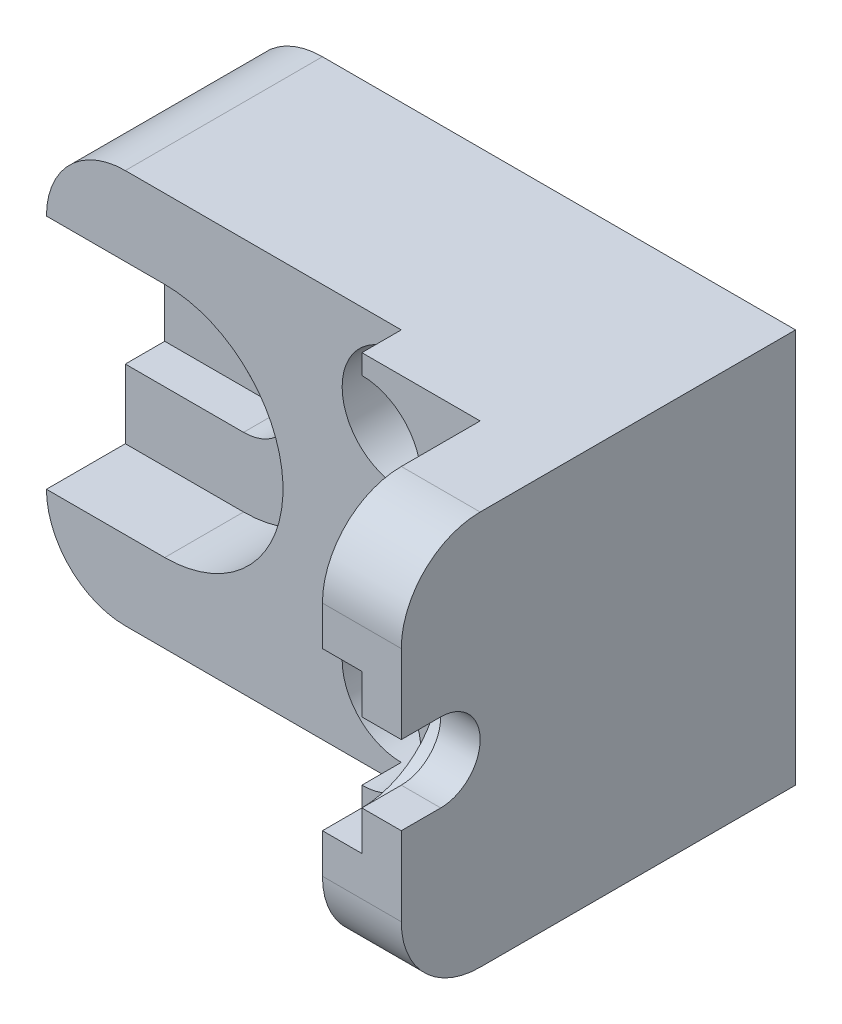
ISO-10303-21;
HEADER;
FILE_DESCRIPTION(('STEP AP214'),'2;1');
FILE_NAME('part.step','',(''),(''),'','','');
FILE_SCHEMA(('AUTOMOTIVE_DESIGN { 1 0 10303 214 1 1 1 1 }'));
ENDSEC;
DATA;
#1=APPLICATION_CONTEXT('core data for automotive mechanical design processes');
#2=APPLICATION_PROTOCOL_DEFINITION('international standard','automotive_design',2000,#1);
#3=PRODUCT_CONTEXT('',#1,'mechanical');
#4=PRODUCT('Part','Part','',(#3));
#5=PRODUCT_RELATED_PRODUCT_CATEGORY('part','',(#4));
#6=PRODUCT_DEFINITION_FORMATION('','',#4);
#7=PRODUCT_DEFINITION_CONTEXT('part definition',#1,'design');
#8=PRODUCT_DEFINITION('design','',#6,#7);
#9=PRODUCT_DEFINITION_SHAPE('','',#8);
#10=(LENGTH_UNIT() NAMED_UNIT(*) SI_UNIT(.MILLI.,.METRE.));
#11=(NAMED_UNIT(*) PLANE_ANGLE_UNIT() SI_UNIT($,.RADIAN.));
#12=(NAMED_UNIT(*) SI_UNIT($,.STERADIAN.) SOLID_ANGLE_UNIT());
#13=UNCERTAINTY_MEASURE_WITH_UNIT(LENGTH_MEASURE(1.E-05),#10,'distance_accuracy_value','');
#14=(GEOMETRIC_REPRESENTATION_CONTEXT(3) GLOBAL_UNCERTAINTY_ASSIGNED_CONTEXT((#13)) GLOBAL_UNIT_ASSIGNED_CONTEXT((#10,
#11,#12)) REPRESENTATION_CONTEXT('',''));
#15=CARTESIAN_POINT('',(0.,0.,0.));
#16=DIRECTION('',(0.,0.,1.));
#17=DIRECTION('',(1.,0.,0.));
#18=AXIS2_PLACEMENT_3D('',#15,#16,#17);
#19=CARTESIAN_POINT('',(9.,8.,6.));
#20=DIRECTION('',(0.,0.,-1.));
#21=DIRECTION('',(-1.,0.,0.));
#22=AXIS2_PLACEMENT_3D('',#19,#20,#21);
#23=CYLINDRICAL_SURFACE('',#22,0.500000000000001);
#24=CARTESIAN_POINT('',(9.,8.,0.));
#25=DIRECTION('',(0.,0.,1.));
#26=DIRECTION('',(1.,0.,0.));
#27=AXIS2_PLACEMENT_3D('',#24,#25,#26);
#28=CIRCLE('',#27,0.500000000000001);
#29=CARTESIAN_POINT('',(9.5,8.,0.));
#30=VERTEX_POINT('',#29);
#31=EDGE_CURVE('E392',#30,#30,#28,.T.);
#32=ORIENTED_EDGE('',*,*,#31,.F.);
#33=EDGE_LOOP('',(#32));
#34=FACE_BOUND('',#33,.T.);
#35=CARTESIAN_POINT('',(9.,8.,2.));
#36=DIRECTION('',(0.,0.,1.));
#37=DIRECTION('',(1.,0.,0.));
#38=AXIS2_PLACEMENT_3D('',#35,#36,#37);
#39=CIRCLE('',#38,0.500000000000001);
#40=CARTESIAN_POINT('',(9.5,8.,2.));
#41=VERTEX_POINT('',#40);
#42=EDGE_CURVE('E39',#41,#41,#39,.T.);
#43=ORIENTED_EDGE('',*,*,#42,.T.);
#44=EDGE_LOOP('',(#43));
#45=FACE_BOUND('',#44,.T.);
#46=ADVANCED_FACE('F35',(#34,#45),#23,.F.);
#47=CARTESIAN_POINT('',(9.,2.,6.));
#48=DIRECTION('',(0.,0.,-1.));
#49=DIRECTION('',(-1.,0.,0.));
#50=AXIS2_PLACEMENT_3D('',#47,#48,#49);
#51=CYLINDRICAL_SURFACE('',#50,0.500000000000001);
#52=CARTESIAN_POINT('',(9.,2.,0.));
#53=DIRECTION('',(0.,0.,1.));
#54=DIRECTION('',(1.,0.,0.));
#55=AXIS2_PLACEMENT_3D('',#52,#53,#54);
#56=CIRCLE('',#55,0.500000000000001);
#57=CARTESIAN_POINT('',(9.5,2.,0.));
#58=VERTEX_POINT('',#57);
#59=EDGE_CURVE('E374',#58,#58,#56,.T.);
#60=ORIENTED_EDGE('',*,*,#59,.F.);
#61=EDGE_LOOP('',(#60));
#62=FACE_BOUND('',#61,.T.);
#63=CARTESIAN_POINT('',(9.,2.,2.));
#64=DIRECTION('',(0.,0.,1.));
#65=DIRECTION('',(1.,0.,0.));
#66=AXIS2_PLACEMENT_3D('',#63,#64,#65);
#67=CIRCLE('',#66,0.500000000000001);
#68=CARTESIAN_POINT('',(9.5,2.,2.));
#69=VERTEX_POINT('',#68);
#70=EDGE_CURVE('E456',#69,#69,#67,.T.);
#71=ORIENTED_EDGE('',*,*,#70,.T.);
#72=EDGE_LOOP('',(#71));
#73=FACE_BOUND('',#72,.T.);
#74=ADVANCED_FACE('F580',(#62,#73),#51,.F.);
#75=CARTESIAN_POINT('',(0.,2.00000000000001,6.));
#76=DIRECTION('',(1.,0.,0.));
#77=DIRECTION('',(0.,0.,-1.));
#78=AXIS2_PLACEMENT_3D('',#75,#76,#77);
#79=PLANE('',#78);
#80=DIRECTION('',(0.,-1.,0.));
#81=VECTOR('',#80,1.);
#82=CARTESIAN_POINT('',(0.,2.00000000000001,3.));
#83=LINE('',#82,#81);
#84=CARTESIAN_POINT('',(0.,3.75,3.));
#85=VERTEX_POINT('',#84);
#86=CARTESIAN_POINT('',(0.,2.,3.));
#87=VERTEX_POINT('',#86);
#88=EDGE_CURVE('E454',#85,#87,#83,.T.);
#89=ORIENTED_EDGE('',*,*,#88,.F.);
#90=DIRECTION('',(0.,0.,-1.));
#91=VECTOR('',#90,1.);
#92=CARTESIAN_POINT('',(0.,3.75,6.));
#93=LINE('',#92,#91);
#94=CARTESIAN_POINT('',(0.,3.75,2.));
#95=VERTEX_POINT('',#94);
#96=EDGE_CURVE('E485',#85,#95,#93,.T.);
#97=ORIENTED_EDGE('',*,*,#96,.T.);
#98=DIRECTION('',(0.,-1.,0.));
#99=VECTOR('',#98,1.);
#100=CARTESIAN_POINT('',(0.,2.00000000000001,2.));
#101=LINE('',#100,#99);
#102=CARTESIAN_POINT('',(0.,6.25,2.));
#103=VERTEX_POINT('',#102);
#104=EDGE_CURVE('E488',#103,#95,#101,.T.);
#105=ORIENTED_EDGE('',*,*,#104,.F.);
#106=DIRECTION('',(0.,0.,1.));
#107=VECTOR('',#106,1.);
#108=CARTESIAN_POINT('',(0.,6.25,6.));
#109=LINE('',#108,#107);
#110=CARTESIAN_POINT('',(0.,6.25,3.));
#111=VERTEX_POINT('',#110);
#112=EDGE_CURVE('E481',#103,#111,#109,.T.);
#113=ORIENTED_EDGE('',*,*,#112,.T.);
#114=CARTESIAN_POINT('',(0.,8.,3.));
#115=VERTEX_POINT('',#114);
#116=EDGE_CURVE('E278',#115,#111,#83,.T.);
#117=ORIENTED_EDGE('',*,*,#116,.F.);
#118=DIRECTION('',(0.,0.,-1.));
#119=VECTOR('',#118,1.);
#120=CARTESIAN_POINT('',(0.,7.99999999999999,6.));
#121=LINE('',#120,#119);
#122=CARTESIAN_POINT('',(0.,7.99999999999999,0.));
#123=VERTEX_POINT('',#122);
#124=EDGE_CURVE('E429',#115,#123,#121,.T.);
#125=ORIENTED_EDGE('',*,*,#124,.T.);
#126=DIRECTION('',(0.,-1.,0.));
#127=VECTOR('',#126,1.);
#128=CARTESIAN_POINT('',(0.,2.00000000000001,0.));
#129=LINE('',#128,#127);
#130=CARTESIAN_POINT('',(0.,2.00000000000001,0.));
#131=VERTEX_POINT('',#130);
#132=EDGE_CURVE('E414',#123,#131,#129,.T.);
#133=ORIENTED_EDGE('',*,*,#132,.T.);
#134=DIRECTION('',(0.,0.,-1.));
#135=VECTOR('',#134,1.);
#136=CARTESIAN_POINT('',(0.,2.00000000000001,6.));
#137=LINE('',#136,#135);
#138=EDGE_CURVE('E425',#87,#131,#137,.T.);
#139=ORIENTED_EDGE('',*,*,#138,.F.);
#140=EDGE_LOOP('',(#89,#97,#105,#113,#117,#125,#133,#139));
#141=FACE_BOUND('',#140,.T.);
#142=ADVANCED_FACE('F518',(#141),#79,.F.);
#143=CARTESIAN_POINT('',(3.,5.,6.));
#144=DIRECTION('',(0.,0.,-1.));
#145=DIRECTION('',(-1.,0.,0.));
#146=AXIS2_PLACEMENT_3D('',#143,#144,#145);
#147=CYLINDRICAL_SURFACE('',#146,1.25);
#148=DIRECTION('',(0.,0.,1.));
#149=VECTOR('',#148,1.);
#150=CARTESIAN_POINT('',(3.,3.75,2.));
#151=LINE('',#150,#149);
#152=CARTESIAN_POINT('',(3.,3.75,2.));
#153=VERTEX_POINT('',#152);
#154=CARTESIAN_POINT('',(3.,3.75,3.));
#155=VERTEX_POINT('',#154);
#156=EDGE_CURVE('E478',#153,#155,#151,.T.);
#157=ORIENTED_EDGE('',*,*,#156,.T.);
#158=CARTESIAN_POINT('',(3.,5.,3.));
#159=DIRECTION('',(0.,0.,1.));
#160=DIRECTION('',(1.,0.,0.));
#161=AXIS2_PLACEMENT_3D('',#158,#159,#160);
#162=CIRCLE('',#161,1.25);
#163=CARTESIAN_POINT('',(3.,6.25,3.));
#164=VERTEX_POINT('',#163);
#165=EDGE_CURVE('E451',#155,#164,#162,.T.);
#166=ORIENTED_EDGE('',*,*,#165,.T.);
#167=DIRECTION('',(0.,0.,1.));
#168=VECTOR('',#167,1.);
#169=CARTESIAN_POINT('',(3.,6.25,2.));
#170=LINE('',#169,#168);
#171=CARTESIAN_POINT('',(3.,6.25,2.));
#172=VERTEX_POINT('',#171);
#173=EDGE_CURVE('E52',#172,#164,#170,.T.);
#174=ORIENTED_EDGE('',*,*,#173,.F.);
#175=CARTESIAN_POINT('',(3.,5.,2.));
#176=DIRECTION('',(0.,0.,1.));
#177=DIRECTION('',(1.,0.,0.));
#178=AXIS2_PLACEMENT_3D('',#175,#176,#177);
#179=CIRCLE('',#178,1.25);
#180=EDGE_CURVE('E11',#172,#153,#179,.T.);
#181=ORIENTED_EDGE('',*,*,#180,.T.);
#182=EDGE_LOOP('',(#157,#166,#174,#181));
#183=FACE_BOUND('',#182,.T.);
#184=CARTESIAN_POINT('',(3.,5.,0.));
#185=DIRECTION('',(0.,0.,1.));
#186=DIRECTION('',(1.,0.,0.));
#187=AXIS2_PLACEMENT_3D('',#184,#185,#186);
#188=CIRCLE('',#187,1.25);
#189=CARTESIAN_POINT('',(4.25,5.,0.));
#190=VERTEX_POINT('',#189);
#191=EDGE_CURVE('E395',#190,#190,#188,.T.);
#192=ORIENTED_EDGE('',*,*,#191,.F.);
#193=EDGE_LOOP('',(#192));
#194=FACE_BOUND('',#193,.T.);
#195=ADVANCED_FACE('F566',(#183,#194),#147,.F.);
#196=CARTESIAN_POINT('',(2.,8.,6.));
#197=DIRECTION('',(0.,0.,-1.));
#198=DIRECTION('',(-1.,0.,0.));
#199=AXIS2_PLACEMENT_3D('',#196,#197,#198);
#200=CYLINDRICAL_SURFACE('',#199,2.);
#201=CARTESIAN_POINT('',(2.,8.,5.));
#202=DIRECTION('',(0.,0.,1.));
#203=DIRECTION('',(1.,0.,0.));
#204=AXIS2_PLACEMENT_3D('',#201,#202,#203);
#205=CIRCLE('',#204,2.);
#206=CARTESIAN_POINT('',(2.00000000000001,10.,5.));
#207=VERTEX_POINT('',#206);
#208=CARTESIAN_POINT('',(0.,8.,5.));
#209=VERTEX_POINT('',#208);
#210=EDGE_CURVE('E294',#207,#209,#205,.T.);
#211=ORIENTED_EDGE('',*,*,#210,.F.);
#212=DIRECTION('',(0.,0.,-1.));
#213=VECTOR('',#212,1.);
#214=CARTESIAN_POINT('',(2.00000000000001,10.,6.));
#215=LINE('',#214,#213);
#216=CARTESIAN_POINT('',(2.00000000000001,10.,0.));
#217=VERTEX_POINT('',#216);
#218=EDGE_CURVE('E432',#207,#217,#215,.T.);
#219=ORIENTED_EDGE('',*,*,#218,.T.);
#220=CARTESIAN_POINT('',(2.,8.,0.));
#221=DIRECTION('',(0.,0.,1.));
#222=DIRECTION('',(-1.,0.,0.));
#223=AXIS2_PLACEMENT_3D('',#220,#221,#222);
#224=CIRCLE('',#223,2.);
#225=EDGE_CURVE('E411',#217,#123,#224,.T.);
#226=ORIENTED_EDGE('',*,*,#225,.T.);
#227=ORIENTED_EDGE('',*,*,#124,.F.);
#228=EDGE_CURVE('E430',#209,#115,#121,.T.);
#229=ORIENTED_EDGE('',*,*,#228,.F.);
#230=EDGE_LOOP('',(#211,#219,#226,#227,#229));
#231=FACE_BOUND('',#230,.T.);
#232=ADVANCED_FACE('F551',(#231),#200,.T.);
#233=CARTESIAN_POINT('',(2.,2.,6.));
#234=DIRECTION('',(0.,0.,-1.));
#235=DIRECTION('',(-1.,0.,0.));
#236=AXIS2_PLACEMENT_3D('',#233,#234,#235);
#237=CYLINDRICAL_SURFACE('',#236,2.);
#238=CARTESIAN_POINT('',(2.,2.,5.));
#239=DIRECTION('',(0.,0.,1.));
#240=DIRECTION('',(1.,0.,0.));
#241=AXIS2_PLACEMENT_3D('',#238,#239,#240);
#242=CIRCLE('',#241,2.);
#243=CARTESIAN_POINT('',(0.,2.,5.));
#244=VERTEX_POINT('',#243);
#245=CARTESIAN_POINT('',(2.00000000000001,0.,5.));
#246=VERTEX_POINT('',#245);
#247=EDGE_CURVE('E292',#244,#246,#242,.T.);
#248=ORIENTED_EDGE('',*,*,#247,.F.);
#249=EDGE_CURVE('E426',#244,#87,#137,.T.);
#250=ORIENTED_EDGE('',*,*,#249,.T.);
#251=ORIENTED_EDGE('',*,*,#138,.T.);
#252=CARTESIAN_POINT('',(2.,2.,0.));
#253=DIRECTION('',(0.,0.,1.));
#254=DIRECTION('',(-1.,0.,0.));
#255=AXIS2_PLACEMENT_3D('',#252,#253,#254);
#256=CIRCLE('',#255,2.);
#257=CARTESIAN_POINT('',(2.00000000000001,0.,0.));
#258=VERTEX_POINT('',#257);
#259=EDGE_CURVE('E417',#131,#258,#256,.T.);
#260=ORIENTED_EDGE('',*,*,#259,.T.);
#261=DIRECTION('',(0.,0.,-1.));
#262=VECTOR('',#261,1.);
#263=CARTESIAN_POINT('',(2.00000000000001,0.,6.));
#264=LINE('',#263,#262);
#265=EDGE_CURVE('E423',#246,#258,#264,.T.);
#266=ORIENTED_EDGE('',*,*,#265,.F.);
#267=EDGE_LOOP('',(#248,#250,#251,#260,#266));
#268=FACE_BOUND('',#267,.T.);
#269=ADVANCED_FACE('F523',(#268),#237,.T.);
#270=CARTESIAN_POINT('',(12.,3.99999999999999,0.));
#271=DIRECTION('',(0.,1.,0.));
#272=DIRECTION('',(0.,0.,1.));
#273=AXIS2_PLACEMENT_3D('',#270,#271,#272);
#274=PLANE('',#273);
#275=DIRECTION('',(1.,0.,0.));
#276=VECTOR('',#275,1.);
#277=CARTESIAN_POINT('',(12.,4.,9.));
#278=LINE('',#277,#276);
#279=CARTESIAN_POINT('',(13.,4.,9.));
#280=VERTEX_POINT('',#279);
#281=CARTESIAN_POINT('',(14.,4.,9.));
#282=VERTEX_POINT('',#281);
#283=EDGE_CURVE('E372',#280,#282,#278,.T.);
#284=ORIENTED_EDGE('',*,*,#283,.F.);
#285=DIRECTION('',(0.,0.,1.));
#286=VECTOR('',#285,1.);
#287=CARTESIAN_POINT('',(13.,3.99999999999999,0.));
#288=LINE('',#287,#286);
#289=CARTESIAN_POINT('',(13.,4.,10.));
#290=VERTEX_POINT('',#289);
#291=EDGE_CURVE('E321',#280,#290,#288,.T.);
#292=ORIENTED_EDGE('',*,*,#291,.T.);
#293=DIRECTION('',(1.,0.,0.));
#294=VECTOR('',#293,1.);
#295=CARTESIAN_POINT('',(12.,4.,10.));
#296=LINE('',#295,#294);
#297=CARTESIAN_POINT('',(14.,4.,10.));
#298=VERTEX_POINT('',#297);
#299=EDGE_CURVE('E352',#290,#298,#296,.T.);
#300=ORIENTED_EDGE('',*,*,#299,.T.);
#301=DIRECTION('',(0.,0.,1.));
#302=VECTOR('',#301,1.);
#303=CARTESIAN_POINT('',(14.,3.99999999999999,0.));
#304=LINE('',#303,#302);
#305=EDGE_CURVE('E331',#282,#298,#304,.T.);
#306=ORIENTED_EDGE('',*,*,#305,.F.);
#307=EDGE_LOOP('',(#284,#292,#300,#306));
#308=FACE_BOUND('',#307,.T.);
#309=ADVANCED_FACE('F607',(#308),#274,.T.);
#310=CARTESIAN_POINT('',(12.,5.,9.));
#311=DIRECTION('',(1.,0.,0.));
#312=DIRECTION('',(0.,0.,-1.));
#313=AXIS2_PLACEMENT_3D('',#310,#311,#312);
#314=CYLINDRICAL_SURFACE('',#313,1.);
#315=CARTESIAN_POINT('',(13.,5.,9.));
#316=DIRECTION('',(-1.,0.,0.));
#317=DIRECTION('',(0.,0.,1.));
#318=AXIS2_PLACEMENT_3D('',#315,#316,#317);
#319=CIRCLE('',#318,1.);
#320=CARTESIAN_POINT('',(13.,6.,9.));
#321=VERTEX_POINT('',#320);
#322=EDGE_CURVE('E324',#280,#321,#319,.F.);
#323=ORIENTED_EDGE('',*,*,#322,.F.);
#324=ORIENTED_EDGE('',*,*,#283,.T.);
#325=CARTESIAN_POINT('',(14.,5.,9.));
#326=DIRECTION('',(1.,0.,0.));
#327=DIRECTION('',(0.,0.,-1.));
#328=AXIS2_PLACEMENT_3D('',#325,#326,#327);
#329=CIRCLE('',#328,1.);
#330=CARTESIAN_POINT('',(14.,6.,9.));
#331=VERTEX_POINT('',#330);
#332=EDGE_CURVE('E335',#282,#331,#329,.T.);
#333=ORIENTED_EDGE('',*,*,#332,.T.);
#334=DIRECTION('',(1.,0.,0.));
#335=VECTOR('',#334,1.);
#336=CARTESIAN_POINT('',(12.,6.,9.));
#337=LINE('',#336,#335);
#338=EDGE_CURVE('E375',#321,#331,#337,.T.);
#339=ORIENTED_EDGE('',*,*,#338,.F.);
#340=EDGE_LOOP('',(#323,#324,#333,#339));
#341=FACE_BOUND('',#340,.T.);
#342=ADVANCED_FACE('F640',(#341),#314,.F.);
#343=CARTESIAN_POINT('',(12.,6.,0.));
#344=DIRECTION('',(0.,1.,0.));
#345=DIRECTION('',(0.,0.,1.));
#346=AXIS2_PLACEMENT_3D('',#343,#344,#345);
#347=PLANE('',#346);
#348=DIRECTION('',(0.,0.,1.));
#349=VECTOR('',#348,1.);
#350=CARTESIAN_POINT('',(13.,6.,0.));
#351=LINE('',#350,#349);
#352=CARTESIAN_POINT('',(13.,6.,10.));
#353=VERTEX_POINT('',#352);
#354=EDGE_CURVE('E326',#321,#353,#351,.T.);
#355=ORIENTED_EDGE('',*,*,#354,.F.);
#356=ORIENTED_EDGE('',*,*,#338,.T.);
#357=DIRECTION('',(0.,0.,1.));
#358=VECTOR('',#357,1.);
#359=CARTESIAN_POINT('',(14.,6.,0.));
#360=LINE('',#359,#358);
#361=CARTESIAN_POINT('',(14.,6.,10.));
#362=VERTEX_POINT('',#361);
#363=EDGE_CURVE('E367',#331,#362,#360,.T.);
#364=ORIENTED_EDGE('',*,*,#363,.T.);
#365=DIRECTION('',(1.,0.,0.));
#366=VECTOR('',#365,1.);
#367=CARTESIAN_POINT('',(12.,6.,10.));
#368=LINE('',#367,#366);
#369=EDGE_CURVE('E377',#353,#362,#368,.T.);
#370=ORIENTED_EDGE('',*,*,#369,.F.);
#371=EDGE_LOOP('',(#355,#356,#364,#370));
#372=FACE_BOUND('',#371,.T.);
#373=ADVANCED_FACE('F598',(#372),#347,.F.);
#374=CARTESIAN_POINT('',(2.,8.,6.));
#375=DIRECTION('',(0.,0.,-1.));
#376=DIRECTION('',(-1.,0.,0.));
#377=AXIS2_PLACEMENT_3D('',#374,#375,#376);
#378=PLANE('',#377);
#379=DIRECTION('',(-1.,0.,0.));
#380=VECTOR('',#379,1.);
#381=CARTESIAN_POINT('',(2.00000000000001,10.,6.));
#382=LINE('',#381,#380);
#383=CARTESIAN_POINT('',(12.,10.,6.));
#384=VERTEX_POINT('',#383);
#385=CARTESIAN_POINT('',(9.,10.,6.));
#386=VERTEX_POINT('',#385);
#387=EDGE_CURVE('E399',#384,#386,#382,.T.);
#388=ORIENTED_EDGE('',*,*,#387,.T.);
#389=DIRECTION('',(0.,1.,0.));
#390=VECTOR('',#389,1.);
#391=CARTESIAN_POINT('',(9.,10.1155799928734,6.));
#392=LINE('',#391,#390);
#393=CARTESIAN_POINT('',(9.,9.5,6.));
#394=VERTEX_POINT('',#393);
#395=EDGE_CURVE('E272',#394,#386,#392,.T.);
#396=ORIENTED_EDGE('',*,*,#395,.F.);
#397=CARTESIAN_POINT('',(9.,8.,6.));
#398=DIRECTION('',(0.,0.,1.));
#399=DIRECTION('',(1.,0.,0.));
#400=AXIS2_PLACEMENT_3D('',#397,#398,#399);
#401=CIRCLE('',#400,1.5);
#402=CARTESIAN_POINT('',(9.,6.5,6.));
#403=VERTEX_POINT('',#402);
#404=EDGE_CURVE('E282',#403,#394,#401,.T.);
#405=ORIENTED_EDGE('',*,*,#404,.F.);
#406=DIRECTION('',(0.,1.,0.));
#407=VECTOR('',#406,1.);
#408=CARTESIAN_POINT('',(9.,6.5,6.));
#409=LINE('',#408,#407);
#410=CARTESIAN_POINT('',(9.,3.5,6.));
#411=VERTEX_POINT('',#410);
#412=EDGE_CURVE('E280',#411,#403,#409,.T.);
#413=ORIENTED_EDGE('',*,*,#412,.F.);
#414=CARTESIAN_POINT('',(9.,2.,6.));
#415=DIRECTION('',(0.,0.,1.));
#416=DIRECTION('',(1.,0.,0.));
#417=AXIS2_PLACEMENT_3D('',#414,#415,#416);
#418=CIRCLE('',#417,1.5);
#419=CARTESIAN_POINT('',(9.,0.5,6.));
#420=VERTEX_POINT('',#419);
#421=EDGE_CURVE('E259',#420,#411,#418,.T.);
#422=ORIENTED_EDGE('',*,*,#421,.F.);
#423=DIRECTION('',(0.,1.,0.));
#424=VECTOR('',#423,1.);
#425=CARTESIAN_POINT('',(9.,0.5,6.));
#426=LINE('',#425,#424);
#427=CARTESIAN_POINT('',(9.,0.,6.));
#428=VERTEX_POINT('',#427);
#429=EDGE_CURVE('E276',#428,#420,#426,.T.);
#430=ORIENTED_EDGE('',*,*,#429,.F.);
#431=DIRECTION('',(1.,0.,0.));
#432=VECTOR('',#431,1.);
#433=CARTESIAN_POINT('',(2.00000000000001,0.,6.));
#434=LINE('',#433,#432);
#435=CARTESIAN_POINT('',(12.,0.,6.));
#436=VERTEX_POINT('',#435);
#437=EDGE_CURVE('E402',#428,#436,#434,.T.);
#438=ORIENTED_EDGE('',*,*,#437,.T.);
#439=DIRECTION('',(0.,-1.,0.));
#440=VECTOR('',#439,1.);
#441=CARTESIAN_POINT('',(12.,0.,6.));
#442=LINE('',#441,#440);
#443=EDGE_CURVE('E340',#384,#436,#442,.T.);
#444=ORIENTED_EDGE('',*,*,#443,.F.);
#445=EDGE_LOOP('',(#388,#396,#405,#413,#422,#430,#438,#444));
#446=FACE_BOUND('',#445,.T.);
#447=ADVANCED_FACE('F534',(#446),#378,.F.);
#448=CARTESIAN_POINT('',(2.,8.,0.));
#449=DIRECTION('',(0.,0.,-1.));
#450=DIRECTION('',(-1.,0.,0.));
#451=AXIS2_PLACEMENT_3D('',#448,#449,#450);
#452=PLANE('',#451);
#453=ORIENTED_EDGE('',*,*,#31,.T.);
#454=EDGE_LOOP('',(#453));
#455=FACE_BOUND('',#454,.T.);
#456=DIRECTION('',(0.,1.,0.));
#457=VECTOR('',#456,1.);
#458=CARTESIAN_POINT('',(14.,0.,0.));
#459=LINE('',#458,#457);
#460=CARTESIAN_POINT('',(14.,0.,0.));
#461=VERTEX_POINT('',#460);
#462=CARTESIAN_POINT('',(14.,10.,0.));
#463=VERTEX_POINT('',#462);
#464=EDGE_CURVE('E398',#461,#463,#459,.T.);
#465=ORIENTED_EDGE('',*,*,#464,.F.);
#466=DIRECTION('',(1.,0.,0.));
#467=VECTOR('',#466,1.);
#468=CARTESIAN_POINT('',(2.00000000000001,0.,0.));
#469=LINE('',#468,#467);
#470=EDGE_CURVE('E403',#258,#461,#469,.T.);
#471=ORIENTED_EDGE('',*,*,#470,.F.);
#472=ORIENTED_EDGE('',*,*,#259,.F.);
#473=ORIENTED_EDGE('',*,*,#132,.F.);
#474=ORIENTED_EDGE('',*,*,#225,.F.);
#475=DIRECTION('',(-1.,0.,0.));
#476=VECTOR('',#475,1.);
#477=CARTESIAN_POINT('',(2.00000000000001,10.,0.));
#478=LINE('',#477,#476);
#479=EDGE_CURVE('E408',#463,#217,#478,.T.);
#480=ORIENTED_EDGE('',*,*,#479,.F.);
#481=EDGE_LOOP('',(#465,#471,#472,#473,#474,#480));
#482=FACE_BOUND('',#481,.T.);
#483=ORIENTED_EDGE('',*,*,#191,.T.);
#484=EDGE_LOOP('',(#483));
#485=FACE_BOUND('',#484,.T.);
#486=ORIENTED_EDGE('',*,*,#59,.T.);
#487=EDGE_LOOP('',(#486));
#488=FACE_BOUND('',#487,.T.);
#489=ADVANCED_FACE('F597',(#455,#482,#485,#488),#452,.T.);
#490=CARTESIAN_POINT('',(14.,0.,6.));
#491=DIRECTION('',(-1.,0.,0.));
#492=DIRECTION('',(0.,0.,1.));
#493=AXIS2_PLACEMENT_3D('',#490,#491,#492);
#494=PLANE('',#493);
#495=ORIENTED_EDGE('',*,*,#464,.T.);
#496=DIRECTION('',(0.,0.,-1.));
#497=VECTOR('',#496,1.);
#498=CARTESIAN_POINT('',(14.,10.,6.));
#499=LINE('',#498,#497);
#500=CARTESIAN_POINT('',(14.,10.,7.99999999999999));
#501=VERTEX_POINT('',#500);
#502=EDGE_CURVE('E434',#501,#463,#499,.T.);
#503=ORIENTED_EDGE('',*,*,#502,.F.);
#504=CARTESIAN_POINT('',(14.,8.,8.));
#505=DIRECTION('',(1.,0.,0.));
#506=DIRECTION('',(0.,0.,-1.));
#507=AXIS2_PLACEMENT_3D('',#504,#505,#506);
#508=CIRCLE('',#507,2.);
#509=CARTESIAN_POINT('',(14.,7.99999999999999,10.));
#510=VERTEX_POINT('',#509);
#511=EDGE_CURVE('E361',#501,#510,#508,.T.);
#512=ORIENTED_EDGE('',*,*,#511,.T.);
#513=DIRECTION('',(0.,-1.,0.));
#514=VECTOR('',#513,1.);
#515=CARTESIAN_POINT('',(14.,0.,10.));
#516=LINE('',#515,#514);
#517=EDGE_CURVE('E364',#510,#362,#516,.T.);
#518=ORIENTED_EDGE('',*,*,#517,.T.);
#519=ORIENTED_EDGE('',*,*,#363,.F.);
#520=ORIENTED_EDGE('',*,*,#332,.F.);
#521=ORIENTED_EDGE('',*,*,#305,.T.);
#522=DIRECTION('',(0.,-1.,0.));
#523=VECTOR('',#522,1.);
#524=CARTESIAN_POINT('',(14.,0.,10.));
#525=LINE('',#524,#523);
#526=CARTESIAN_POINT('',(14.,2.00000000000001,10.));
#527=VERTEX_POINT('',#526);
#528=EDGE_CURVE('E355',#298,#527,#525,.T.);
#529=ORIENTED_EDGE('',*,*,#528,.T.);
#530=CARTESIAN_POINT('',(14.,2.,8.));
#531=DIRECTION('',(1.,0.,0.));
#532=DIRECTION('',(0.,0.,-1.));
#533=AXIS2_PLACEMENT_3D('',#530,#531,#532);
#534=CIRCLE('',#533,2.);
#535=CARTESIAN_POINT('',(14.,0.,7.99999999999999));
#536=VERTEX_POINT('',#535);
#537=EDGE_CURVE('E358',#536,#527,#534,.F.);
#538=ORIENTED_EDGE('',*,*,#537,.F.);
#539=DIRECTION('',(0.,0.,-1.));
#540=VECTOR('',#539,1.);
#541=CARTESIAN_POINT('',(14.,0.,6.));
#542=LINE('',#541,#540);
#543=EDGE_CURVE('E405',#536,#461,#542,.T.);
#544=ORIENTED_EDGE('',*,*,#543,.T.);
#545=EDGE_LOOP('',(#495,#503,#512,#518,#519,#520,#521,#529,#538,#544));
#546=FACE_BOUND('',#545,.T.);
#547=ADVANCED_FACE('F37',(#546),#494,.F.);
#548=CARTESIAN_POINT('',(2.00000000000001,10.,6.));
#549=DIRECTION('',(0.,-1.,0.));
#550=DIRECTION('',(0.,0.,-1.));
#551=AXIS2_PLACEMENT_3D('',#548,#549,#550);
#552=PLANE('',#551);
#553=DIRECTION('',(-1.,0.,0.));
#554=VECTOR('',#553,1.);
#555=CARTESIAN_POINT('',(2.00000000000001,10.,5.));
#556=LINE('',#555,#554);
#557=CARTESIAN_POINT('',(9.,10.,5.));
#558=VERTEX_POINT('',#557);
#559=EDGE_CURVE('E297',#558,#207,#556,.T.);
#560=ORIENTED_EDGE('',*,*,#559,.F.);
#561=DIRECTION('',(0.,0.,1.));
#562=VECTOR('',#561,1.);
#563=CARTESIAN_POINT('',(9.,10.,6.));
#564=LINE('',#563,#562);
#565=EDGE_CURVE('E446',#558,#386,#564,.T.);
#566=ORIENTED_EDGE('',*,*,#565,.T.);
#567=ORIENTED_EDGE('',*,*,#387,.F.);
#568=DIRECTION('',(0.,0.,1.));
#569=VECTOR('',#568,1.);
#570=CARTESIAN_POINT('',(12.,10.,0.));
#571=LINE('',#570,#569);
#572=CARTESIAN_POINT('',(12.,10.,7.99999999999999));
#573=VERTEX_POINT('',#572);
#574=EDGE_CURVE('E343',#384,#573,#571,.T.);
#575=ORIENTED_EDGE('',*,*,#574,.T.);
#576=DIRECTION('',(1.,0.,0.));
#577=VECTOR('',#576,1.);
#578=CARTESIAN_POINT('',(12.,10.,7.99999999999999));
#579=LINE('',#578,#577);
#580=EDGE_CURVE('E381',#573,#501,#579,.T.);
#581=ORIENTED_EDGE('',*,*,#580,.T.);
#582=ORIENTED_EDGE('',*,*,#502,.T.);
#583=ORIENTED_EDGE('',*,*,#479,.T.);
#584=ORIENTED_EDGE('',*,*,#218,.F.);
#585=EDGE_LOOP('',(#560,#566,#567,#575,#581,#582,#583,#584));
#586=FACE_BOUND('',#585,.T.);
#587=ADVANCED_FACE('F547',(#586),#552,.F.);
#588=CARTESIAN_POINT('',(2.00000000000001,0.,6.));
#589=DIRECTION('',(0.,1.,0.));
#590=DIRECTION('',(0.,0.,1.));
#591=AXIS2_PLACEMENT_3D('',#588,#589,#590);
#592=PLANE('',#591);
#593=ORIENTED_EDGE('',*,*,#437,.F.);
#594=DIRECTION('',(0.,0.,-1.));
#595=VECTOR('',#594,1.);
#596=CARTESIAN_POINT('',(9.,0.,6.));
#597=LINE('',#596,#595);
#598=CARTESIAN_POINT('',(9.,0.,5.));
#599=VERTEX_POINT('',#598);
#600=EDGE_CURVE('E443',#428,#599,#597,.T.);
#601=ORIENTED_EDGE('',*,*,#600,.T.);
#602=DIRECTION('',(1.,0.,0.));
#603=VECTOR('',#602,1.);
#604=CARTESIAN_POINT('',(2.00000000000001,0.,5.));
#605=LINE('',#604,#603);
#606=EDGE_CURVE('E288',#246,#599,#605,.T.);
#607=ORIENTED_EDGE('',*,*,#606,.F.);
#608=ORIENTED_EDGE('',*,*,#265,.T.);
#609=ORIENTED_EDGE('',*,*,#470,.T.);
#610=ORIENTED_EDGE('',*,*,#543,.F.);
#611=DIRECTION('',(1.,0.,0.));
#612=VECTOR('',#611,1.);
#613=CARTESIAN_POINT('',(12.,0.,7.99999999999999));
#614=LINE('',#613,#612);
#615=CARTESIAN_POINT('',(12.,0.,7.99999999999999));
#616=VERTEX_POINT('',#615);
#617=EDGE_CURVE('E384',#616,#536,#614,.T.);
#618=ORIENTED_EDGE('',*,*,#617,.F.);
#619=DIRECTION('',(0.,0.,1.));
#620=VECTOR('',#619,1.);
#621=CARTESIAN_POINT('',(12.,0.,0.));
#622=LINE('',#621,#620);
#623=EDGE_CURVE('E338',#436,#616,#622,.T.);
#624=ORIENTED_EDGE('',*,*,#623,.F.);
#625=EDGE_LOOP('',(#593,#601,#607,#608,#609,#610,#618,#624));
#626=FACE_BOUND('',#625,.T.);
#627=ADVANCED_FACE('F528',(#626),#592,.F.);
#628=CARTESIAN_POINT('',(12.,0.,10.));
#629=DIRECTION('',(0.,0.,1.));
#630=DIRECTION('',(1.,0.,0.));
#631=AXIS2_PLACEMENT_3D('',#628,#629,#630);
#632=PLANE('',#631);
#633=DIRECTION('',(-1.,0.,0.));
#634=VECTOR('',#633,1.);
#635=CARTESIAN_POINT('',(12.,7.,10.));
#636=LINE('',#635,#634);
#637=CARTESIAN_POINT('',(13.,7.,10.));
#638=VERTEX_POINT('',#637);
#639=CARTESIAN_POINT('',(12.,7.,10.));
#640=VERTEX_POINT('',#639);
#641=EDGE_CURVE('E319',#638,#640,#636,.T.);
#642=ORIENTED_EDGE('',*,*,#641,.F.);
#643=DIRECTION('',(0.,-1.,0.));
#644=VECTOR('',#643,1.);
#645=CARTESIAN_POINT('',(13.,0.,10.));
#646=LINE('',#645,#644);
#647=EDGE_CURVE('E328',#638,#353,#646,.T.);
#648=ORIENTED_EDGE('',*,*,#647,.T.);
#649=ORIENTED_EDGE('',*,*,#369,.T.);
#650=ORIENTED_EDGE('',*,*,#517,.F.);
#651=DIRECTION('',(1.,0.,0.));
#652=VECTOR('',#651,1.);
#653=CARTESIAN_POINT('',(12.,7.99999999999999,10.));
#654=LINE('',#653,#652);
#655=CARTESIAN_POINT('',(12.,7.99999999999999,10.));
#656=VERTEX_POINT('',#655);
#657=EDGE_CURVE('E379',#656,#510,#654,.T.);
#658=ORIENTED_EDGE('',*,*,#657,.F.);
#659=DIRECTION('',(0.,-1.,0.));
#660=VECTOR('',#659,1.);
#661=CARTESIAN_POINT('',(12.,0.,10.));
#662=LINE('',#661,#660);
#663=EDGE_CURVE('E349',#656,#640,#662,.T.);
#664=ORIENTED_EDGE('',*,*,#663,.T.);
#665=EDGE_LOOP('',(#642,#648,#649,#650,#658,#664));
#666=FACE_BOUND('',#665,.T.);
#667=ADVANCED_FACE('F604',(#666),#632,.T.);
#668=CARTESIAN_POINT('',(12.,8.,8.));
#669=DIRECTION('',(1.,0.,0.));
#670=DIRECTION('',(0.,0.,-1.));
#671=AXIS2_PLACEMENT_3D('',#668,#669,#670);
#672=CYLINDRICAL_SURFACE('',#671,2.);
#673=ORIENTED_EDGE('',*,*,#511,.F.);
#674=ORIENTED_EDGE('',*,*,#580,.F.);
#675=CARTESIAN_POINT('',(12.,8.,8.));
#676=DIRECTION('',(1.,0.,0.));
#677=DIRECTION('',(0.,0.,-1.));
#678=AXIS2_PLACEMENT_3D('',#675,#676,#677);
#679=CIRCLE('',#678,2.);
#680=EDGE_CURVE('E346',#573,#656,#679,.T.);
#681=ORIENTED_EDGE('',*,*,#680,.T.);
#682=ORIENTED_EDGE('',*,*,#657,.T.);
#683=EDGE_LOOP('',(#673,#674,#681,#682));
#684=FACE_BOUND('',#683,.T.);
#685=ADVANCED_FACE('F627',(#684),#672,.T.);
#686=CARTESIAN_POINT('',(12.,2.,8.));
#687=DIRECTION('',(1.,0.,0.));
#688=DIRECTION('',(0.,0.,-1.));
#689=AXIS2_PLACEMENT_3D('',#686,#687,#688);
#690=CYLINDRICAL_SURFACE('',#689,2.);
#691=ORIENTED_EDGE('',*,*,#537,.T.);
#692=DIRECTION('',(1.,0.,0.));
#693=VECTOR('',#692,1.);
#694=CARTESIAN_POINT('',(12.,2.00000000000001,10.));
#695=LINE('',#694,#693);
#696=CARTESIAN_POINT('',(12.,2.00000000000001,10.));
#697=VERTEX_POINT('',#696);
#698=EDGE_CURVE('E387',#697,#527,#695,.T.);
#699=ORIENTED_EDGE('',*,*,#698,.F.);
#700=CARTESIAN_POINT('',(12.,2.,8.));
#701=DIRECTION('',(1.,0.,0.));
#702=DIRECTION('',(0.,0.,-1.));
#703=AXIS2_PLACEMENT_3D('',#700,#701,#702);
#704=CIRCLE('',#703,2.);
#705=EDGE_CURVE('E334',#616,#697,#704,.F.);
#706=ORIENTED_EDGE('',*,*,#705,.F.);
#707=ORIENTED_EDGE('',*,*,#617,.T.);
#708=EDGE_LOOP('',(#691,#699,#706,#707));
#709=FACE_BOUND('',#708,.T.);
#710=ADVANCED_FACE('F651',(#709),#690,.T.);
#711=CARTESIAN_POINT('',(12.,0.,10.));
#712=DIRECTION('',(0.,0.,1.));
#713=DIRECTION('',(1.,0.,0.));
#714=AXIS2_PLACEMENT_3D('',#711,#712,#713);
#715=PLANE('',#714);
#716=DIRECTION('',(1.,0.,0.));
#717=VECTOR('',#716,1.);
#718=CARTESIAN_POINT('',(12.,3.,10.));
#719=LINE('',#718,#717);
#720=CARTESIAN_POINT('',(12.,3.,10.));
#721=VERTEX_POINT('',#720);
#722=CARTESIAN_POINT('',(13.,3.,10.));
#723=VERTEX_POINT('',#722);
#724=EDGE_CURVE('E315',#721,#723,#719,.T.);
#725=ORIENTED_EDGE('',*,*,#724,.F.);
#726=DIRECTION('',(0.,-1.,0.));
#727=VECTOR('',#726,1.);
#728=CARTESIAN_POINT('',(12.,0.,10.));
#729=LINE('',#728,#727);
#730=EDGE_CURVE('E332',#721,#697,#729,.T.);
#731=ORIENTED_EDGE('',*,*,#730,.T.);
#732=ORIENTED_EDGE('',*,*,#698,.T.);
#733=ORIENTED_EDGE('',*,*,#528,.F.);
#734=ORIENTED_EDGE('',*,*,#299,.F.);
#735=DIRECTION('',(0.,-1.,0.));
#736=VECTOR('',#735,1.);
#737=CARTESIAN_POINT('',(13.,0.,10.));
#738=LINE('',#737,#736);
#739=EDGE_CURVE('E440',#290,#723,#738,.T.);
#740=ORIENTED_EDGE('',*,*,#739,.T.);
#741=EDGE_LOOP('',(#725,#731,#732,#733,#734,#740));
#742=FACE_BOUND('',#741,.T.);
#743=ADVANCED_FACE('F648',(#742),#715,.T.);
#744=CARTESIAN_POINT('',(12.,0.,0.));
#745=DIRECTION('',(1.,0.,0.));
#746=DIRECTION('',(0.,0.,-1.));
#747=AXIS2_PLACEMENT_3D('',#744,#745,#746);
#748=PLANE('',#747);
#749=CARTESIAN_POINT('',(12.,5.,9.));
#750=DIRECTION('',(-1.,0.,0.));
#751=DIRECTION('',(0.,0.,1.));
#752=AXIS2_PLACEMENT_3D('',#749,#750,#751);
#753=CIRCLE('',#752,2.);
#754=CARTESIAN_POINT('',(12.,7.,9.));
#755=VERTEX_POINT('',#754);
#756=CARTESIAN_POINT('',(12.,3.,9.));
#757=VERTEX_POINT('',#756);
#758=EDGE_CURVE('E299',#755,#757,#753,.T.);
#759=ORIENTED_EDGE('',*,*,#758,.F.);
#760=DIRECTION('',(0.,0.,1.));
#761=VECTOR('',#760,1.);
#762=CARTESIAN_POINT('',(12.,7.,0.));
#763=LINE('',#762,#761);
#764=EDGE_CURVE('E437',#755,#640,#763,.T.);
#765=ORIENTED_EDGE('',*,*,#764,.T.);
#766=ORIENTED_EDGE('',*,*,#663,.F.);
#767=ORIENTED_EDGE('',*,*,#680,.F.);
#768=ORIENTED_EDGE('',*,*,#574,.F.);
#769=ORIENTED_EDGE('',*,*,#443,.T.);
#770=ORIENTED_EDGE('',*,*,#623,.T.);
#771=ORIENTED_EDGE('',*,*,#705,.T.);
#772=ORIENTED_EDGE('',*,*,#730,.F.);
#773=DIRECTION('',(0.,0.,1.));
#774=VECTOR('',#773,1.);
#775=CARTESIAN_POINT('',(12.,3.,9.));
#776=LINE('',#775,#774);
#777=EDGE_CURVE('E304',#757,#721,#776,.T.);
#778=ORIENTED_EDGE('',*,*,#777,.F.);
#779=EDGE_LOOP('',(#759,#765,#766,#767,#768,#769,#770,#771,#772,#778));
#780=FACE_BOUND('',#779,.T.);
#781=ADVANCED_FACE('F656',(#780),#748,.F.);
#782=CARTESIAN_POINT('',(13.,5.,9.));
#783=DIRECTION('',(-1.,0.,0.));
#784=DIRECTION('',(0.,0.,1.));
#785=AXIS2_PLACEMENT_3D('',#782,#783,#784);
#786=CYLINDRICAL_SURFACE('',#785,2.);
#787=ORIENTED_EDGE('',*,*,#758,.T.);
#788=DIRECTION('',(-1.,0.,0.));
#789=VECTOR('',#788,1.);
#790=CARTESIAN_POINT('',(13.,3.,9.));
#791=LINE('',#790,#789);
#792=CARTESIAN_POINT('',(13.,3.,9.));
#793=VERTEX_POINT('',#792);
#794=EDGE_CURVE('E309',#793,#757,#791,.T.);
#795=ORIENTED_EDGE('',*,*,#794,.F.);
#796=CARTESIAN_POINT('',(13.,5.,9.));
#797=DIRECTION('',(-1.,0.,0.));
#798=DIRECTION('',(0.,0.,1.));
#799=AXIS2_PLACEMENT_3D('',#796,#797,#798);
#800=CIRCLE('',#799,2.);
#801=CARTESIAN_POINT('',(13.,7.,9.));
#802=VERTEX_POINT('',#801);
#803=EDGE_CURVE('E300',#802,#793,#800,.T.);
#804=ORIENTED_EDGE('',*,*,#803,.F.);
#805=DIRECTION('',(-1.,0.,0.));
#806=VECTOR('',#805,1.);
#807=CARTESIAN_POINT('',(13.,7.,9.));
#808=LINE('',#807,#806);
#809=EDGE_CURVE('E312',#802,#755,#808,.T.);
#810=ORIENTED_EDGE('',*,*,#809,.T.);
#811=EDGE_LOOP('',(#787,#795,#804,#810));
#812=FACE_BOUND('',#811,.T.);
#813=ADVANCED_FACE('F670',(#812),#786,.F.);
#814=CARTESIAN_POINT('',(13.,7.,9.));
#815=DIRECTION('',(0.,1.,0.));
#816=DIRECTION('',(0.,0.,1.));
#817=AXIS2_PLACEMENT_3D('',#814,#815,#816);
#818=PLANE('',#817);
#819=ORIENTED_EDGE('',*,*,#641,.T.);
#820=ORIENTED_EDGE('',*,*,#764,.F.);
#821=ORIENTED_EDGE('',*,*,#809,.F.);
#822=DIRECTION('',(0.,0.,-1.));
#823=VECTOR('',#822,1.);
#824=CARTESIAN_POINT('',(13.,7.,9.));
#825=LINE('',#824,#823);
#826=EDGE_CURVE('E307',#638,#802,#825,.T.);
#827=ORIENTED_EDGE('',*,*,#826,.F.);
#828=EDGE_LOOP('',(#819,#820,#821,#827));
#829=FACE_BOUND('',#828,.T.);
#830=ADVANCED_FACE('F660',(#829),#818,.F.);
#831=CARTESIAN_POINT('',(13.,3.,9.));
#832=DIRECTION('',(0.,-1.,0.));
#833=DIRECTION('',(0.,0.,-1.));
#834=AXIS2_PLACEMENT_3D('',#831,#832,#833);
#835=PLANE('',#834);
#836=ORIENTED_EDGE('',*,*,#724,.T.);
#837=DIRECTION('',(0.,0.,1.));
#838=VECTOR('',#837,1.);
#839=CARTESIAN_POINT('',(13.,3.,9.));
#840=LINE('',#839,#838);
#841=EDGE_CURVE('E303',#793,#723,#840,.T.);
#842=ORIENTED_EDGE('',*,*,#841,.F.);
#843=ORIENTED_EDGE('',*,*,#794,.T.);
#844=ORIENTED_EDGE('',*,*,#777,.T.);
#845=EDGE_LOOP('',(#836,#842,#843,#844));
#846=FACE_BOUND('',#845,.T.);
#847=ADVANCED_FACE('F668',(#846),#835,.F.);
#848=CARTESIAN_POINT('',(13.,5.,9.));
#849=DIRECTION('',(-1.,0.,0.));
#850=DIRECTION('',(0.,0.,1.));
#851=AXIS2_PLACEMENT_3D('',#848,#849,#850);
#852=PLANE('',#851);
#853=ORIENTED_EDGE('',*,*,#826,.T.);
#854=ORIENTED_EDGE('',*,*,#803,.T.);
#855=ORIENTED_EDGE('',*,*,#841,.T.);
#856=ORIENTED_EDGE('',*,*,#739,.F.);
#857=ORIENTED_EDGE('',*,*,#291,.F.);
#858=ORIENTED_EDGE('',*,*,#322,.T.);
#859=ORIENTED_EDGE('',*,*,#354,.T.);
#860=ORIENTED_EDGE('',*,*,#647,.F.);
#861=EDGE_LOOP('',(#853,#854,#855,#856,#857,#858,#859,#860));
#862=FACE_BOUND('',#861,.T.);
#863=ADVANCED_FACE('F664',(#862),#852,.T.);
#864=CARTESIAN_POINT('',(9.,10.1155799928734,5.));
#865=DIRECTION('',(1.,0.,0.));
#866=DIRECTION('',(0.,0.,-1.));
#867=AXIS2_PLACEMENT_3D('',#864,#865,#866);
#868=PLANE('',#867);
#869=DIRECTION('',(0.,1.,0.));
#870=VECTOR('',#869,1.);
#871=CARTESIAN_POINT('',(9.,10.1155799928734,5.));
#872=LINE('',#871,#870);
#873=CARTESIAN_POINT('',(9.,9.5,5.));
#874=VERTEX_POINT('',#873);
#875=EDGE_CURVE('E268',#874,#558,#872,.T.);
#876=ORIENTED_EDGE('',*,*,#875,.F.);
#877=DIRECTION('',(0.,0.,1.));
#878=VECTOR('',#877,1.);
#879=CARTESIAN_POINT('',(9.,9.5,5.));
#880=LINE('',#879,#878);
#881=EDGE_CURVE('E286',#874,#394,#880,.T.);
#882=ORIENTED_EDGE('',*,*,#881,.T.);
#883=ORIENTED_EDGE('',*,*,#395,.T.);
#884=ORIENTED_EDGE('',*,*,#565,.F.);
#885=EDGE_LOOP('',(#876,#882,#883,#884));
#886=FACE_BOUND('',#885,.T.);
#887=ADVANCED_FACE('F771',(#886),#868,.F.);
#888=CARTESIAN_POINT('',(9.,0.5,5.));
#889=DIRECTION('',(1.,0.,0.));
#890=DIRECTION('',(0.,0.,-1.));
#891=AXIS2_PLACEMENT_3D('',#888,#889,#890);
#892=PLANE('',#891);
#893=ORIENTED_EDGE('',*,*,#429,.T.);
#894=DIRECTION('',(0.,0.,1.));
#895=VECTOR('',#894,1.);
#896=CARTESIAN_POINT('',(9.,0.5,5.));
#897=LINE('',#896,#895);
#898=CARTESIAN_POINT('',(9.,0.5,5.));
#899=VERTEX_POINT('',#898);
#900=EDGE_CURVE('E264',#899,#420,#897,.T.);
#901=ORIENTED_EDGE('',*,*,#900,.F.);
#902=DIRECTION('',(0.,1.,0.));
#903=VECTOR('',#902,1.);
#904=CARTESIAN_POINT('',(9.,0.5,5.));
#905=LINE('',#904,#903);
#906=EDGE_CURVE('E248',#599,#899,#905,.T.);
#907=ORIENTED_EDGE('',*,*,#906,.F.);
#908=ORIENTED_EDGE('',*,*,#600,.F.);
#909=EDGE_LOOP('',(#893,#901,#907,#908));
#910=FACE_BOUND('',#909,.T.);
#911=ADVANCED_FACE('F532',(#910),#892,.F.);
#912=CARTESIAN_POINT('',(9.,8.,5.));
#913=DIRECTION('',(0.,0.,1.));
#914=DIRECTION('',(1.,0.,0.));
#915=AXIS2_PLACEMENT_3D('',#912,#913,#914);
#916=PLANE('',#915);
#917=CARTESIAN_POINT('',(9.,8.,5.));
#918=DIRECTION('',(0.,0.,1.));
#919=DIRECTION('',(1.,0.,0.));
#920=AXIS2_PLACEMENT_3D('',#917,#918,#919);
#921=CIRCLE('',#920,1.5);
#922=CARTESIAN_POINT('',(9.,6.5,5.));
#923=VERTEX_POINT('',#922);
#924=EDGE_CURVE('E464',#874,#923,#921,.T.);
#925=ORIENTED_EDGE('',*,*,#924,.F.);
#926=ORIENTED_EDGE('',*,*,#875,.T.);
#927=ORIENTED_EDGE('',*,*,#559,.T.);
#928=ORIENTED_EDGE('',*,*,#210,.T.);
#929=DIRECTION('',(-1.,0.,0.));
#930=VECTOR('',#929,1.);
#931=CARTESIAN_POINT('',(3.,8.,5.));
#932=LINE('',#931,#930);
#933=CARTESIAN_POINT('',(3.,8.,5.));
#934=VERTEX_POINT('',#933);
#935=EDGE_CURVE('E494',#934,#209,#932,.T.);
#936=ORIENTED_EDGE('',*,*,#935,.F.);
#937=CARTESIAN_POINT('',(3.,5.,5.));
#938=DIRECTION('',(0.,0.,1.));
#939=DIRECTION('',(1.,0.,0.));
#940=AXIS2_PLACEMENT_3D('',#937,#938,#939);
#941=CIRCLE('',#940,3.);
#942=CARTESIAN_POINT('',(3.,2.,5.));
#943=VERTEX_POINT('',#942);
#944=EDGE_CURVE('E60',#943,#934,#941,.T.);
#945=ORIENTED_EDGE('',*,*,#944,.F.);
#946=DIRECTION('',(1.,0.,0.));
#947=VECTOR('',#946,1.);
#948=CARTESIAN_POINT('',(9.,2.,5.));
#949=LINE('',#948,#947);
#950=EDGE_CURVE('E449',#244,#943,#949,.T.);
#951=ORIENTED_EDGE('',*,*,#950,.F.);
#952=ORIENTED_EDGE('',*,*,#247,.T.);
#953=ORIENTED_EDGE('',*,*,#606,.T.);
#954=ORIENTED_EDGE('',*,*,#906,.T.);
#955=CARTESIAN_POINT('',(9.,2.,5.));
#956=DIRECTION('',(0.,0.,1.));
#957=DIRECTION('',(1.,0.,0.));
#958=AXIS2_PLACEMENT_3D('',#955,#956,#957);
#959=CIRCLE('',#958,1.5);
#960=CARTESIAN_POINT('',(9.,3.5,5.));
#961=VERTEX_POINT('',#960);
#962=EDGE_CURVE('E242',#961,#899,#959,.T.);
#963=ORIENTED_EDGE('',*,*,#962,.F.);
#964=DIRECTION('',(0.,1.,0.));
#965=VECTOR('',#964,1.);
#966=CARTESIAN_POINT('',(9.,6.5,5.));
#967=LINE('',#966,#965);
#968=EDGE_CURVE('E246',#961,#923,#967,.T.);
#969=ORIENTED_EDGE('',*,*,#968,.T.);
#970=EDGE_LOOP('',(#925,#926,#927,#928,#936,#945,#951,#952,#953,#954,#963,#969));
#971=FACE_BOUND('',#970,.T.);
#972=ADVANCED_FACE('F244',(#971),#916,.T.);
#973=CARTESIAN_POINT('',(9.,8.,5.));
#974=DIRECTION('',(0.,0.,1.));
#975=DIRECTION('',(1.,0.,0.));
#976=AXIS2_PLACEMENT_3D('',#973,#974,#975);
#977=CYLINDRICAL_SURFACE('',#976,1.5);
#978=ORIENTED_EDGE('',*,*,#404,.T.);
#979=ORIENTED_EDGE('',*,*,#881,.F.);
#980=ORIENTED_EDGE('',*,*,#924,.T.);
#981=DIRECTION('',(0.,0.,1.));
#982=VECTOR('',#981,1.);
#983=CARTESIAN_POINT('',(9.,6.5,5.));
#984=LINE('',#983,#982);
#985=EDGE_CURVE('E263',#923,#403,#984,.T.);
#986=ORIENTED_EDGE('',*,*,#985,.T.);
#987=EDGE_LOOP('',(#978,#979,#980,#986));
#988=FACE_BOUND('',#987,.T.);
#989=CARTESIAN_POINT('',(9.,8.,2.));
#990=DIRECTION('',(0.,0.,1.));
#991=DIRECTION('',(1.,0.,0.));
#992=AXIS2_PLACEMENT_3D('',#989,#990,#991);
#993=CIRCLE('',#992,1.5);
#994=CARTESIAN_POINT('',(10.5,8.,2.));
#995=VERTEX_POINT('',#994);
#996=EDGE_CURVE('E458',#995,#995,#993,.T.);
#997=ORIENTED_EDGE('',*,*,#996,.F.);
#998=EDGE_LOOP('',(#997));
#999=FACE_BOUND('',#998,.T.);
#1000=ADVANCED_FACE('F539',(#988,#999),#977,.F.);
#1001=CARTESIAN_POINT('',(9.,6.5,5.));
#1002=DIRECTION('',(1.,0.,0.));
#1003=DIRECTION('',(0.,0.,-1.));
#1004=AXIS2_PLACEMENT_3D('',#1001,#1002,#1003);
#1005=PLANE('',#1004);
#1006=ORIENTED_EDGE('',*,*,#412,.T.);
#1007=ORIENTED_EDGE('',*,*,#985,.F.);
#1008=ORIENTED_EDGE('',*,*,#968,.F.);
#1009=DIRECTION('',(0.,0.,1.));
#1010=VECTOR('',#1009,1.);
#1011=CARTESIAN_POINT('',(9.,3.5,5.));
#1012=LINE('',#1011,#1010);
#1013=EDGE_CURVE('E255',#961,#411,#1012,.T.);
#1014=ORIENTED_EDGE('',*,*,#1013,.T.);
#1015=EDGE_LOOP('',(#1006,#1007,#1008,#1014));
#1016=FACE_BOUND('',#1015,.T.);
#1017=ADVANCED_FACE('F267',(#1016),#1005,.F.);
#1018=CARTESIAN_POINT('',(9.,2.,5.));
#1019=DIRECTION('',(0.,0.,1.));
#1020=DIRECTION('',(1.,0.,0.));
#1021=AXIS2_PLACEMENT_3D('',#1018,#1019,#1020);
#1022=CYLINDRICAL_SURFACE('',#1021,1.5);
#1023=ORIENTED_EDGE('',*,*,#421,.T.);
#1024=ORIENTED_EDGE('',*,*,#1013,.F.);
#1025=ORIENTED_EDGE('',*,*,#962,.T.);
#1026=ORIENTED_EDGE('',*,*,#900,.T.);
#1027=EDGE_LOOP('',(#1023,#1024,#1025,#1026));
#1028=FACE_BOUND('',#1027,.T.);
#1029=CARTESIAN_POINT('',(9.,2.,2.));
#1030=DIRECTION('',(0.,0.,1.));
#1031=DIRECTION('',(1.,0.,0.));
#1032=AXIS2_PLACEMENT_3D('',#1029,#1030,#1031);
#1033=CIRCLE('',#1032,1.5);
#1034=CARTESIAN_POINT('',(10.5,2.,2.));
#1035=VERTEX_POINT('',#1034);
#1036=EDGE_CURVE('E252',#1035,#1035,#1033,.T.);
#1037=ORIENTED_EDGE('',*,*,#1036,.F.);
#1038=EDGE_LOOP('',(#1037));
#1039=FACE_BOUND('',#1038,.T.);
#1040=ADVANCED_FACE('F256',(#1028,#1039),#1022,.F.);
#1041=CARTESIAN_POINT('',(3.,5.,3.));
#1042=DIRECTION('',(0.,0.,1.));
#1043=DIRECTION('',(1.,0.,0.));
#1044=AXIS2_PLACEMENT_3D('',#1041,#1042,#1043);
#1045=PLANE('',#1044);
#1046=DIRECTION('',(1.,0.,0.));
#1047=VECTOR('',#1046,1.);
#1048=CARTESIAN_POINT('',(3.,3.75,3.));
#1049=LINE('',#1048,#1047);
#1050=EDGE_CURVE('E44',#85,#155,#1049,.T.);
#1051=ORIENTED_EDGE('',*,*,#1050,.F.);
#1052=ORIENTED_EDGE('',*,*,#88,.T.);
#1053=DIRECTION('',(1.,0.,0.));
#1054=VECTOR('',#1053,1.);
#1055=CARTESIAN_POINT('',(3.,2.,3.));
#1056=LINE('',#1055,#1054);
#1057=CARTESIAN_POINT('',(3.,2.,3.));
#1058=VERTEX_POINT('',#1057);
#1059=EDGE_CURVE('E497',#87,#1058,#1056,.T.);
#1060=ORIENTED_EDGE('',*,*,#1059,.T.);
#1061=CARTESIAN_POINT('',(3.,5.,3.));
#1062=DIRECTION('',(0.,0.,1.));
#1063=DIRECTION('',(1.,0.,0.));
#1064=AXIS2_PLACEMENT_3D('',#1061,#1062,#1063);
#1065=CIRCLE('',#1064,3.);
#1066=CARTESIAN_POINT('',(3.,8.,3.));
#1067=VERTEX_POINT('',#1066);
#1068=EDGE_CURVE('E490',#1058,#1067,#1065,.T.);
#1069=ORIENTED_EDGE('',*,*,#1068,.T.);
#1070=DIRECTION('',(-1.,0.,0.));
#1071=VECTOR('',#1070,1.);
#1072=CARTESIAN_POINT('',(3.,8.,3.));
#1073=LINE('',#1072,#1071);
#1074=EDGE_CURVE('E493',#1067,#115,#1073,.T.);
#1075=ORIENTED_EDGE('',*,*,#1074,.T.);
#1076=ORIENTED_EDGE('',*,*,#116,.T.);
#1077=DIRECTION('',(-1.,0.,0.));
#1078=VECTOR('',#1077,1.);
#1079=CARTESIAN_POINT('',(3.,6.25,3.));
#1080=LINE('',#1079,#1078);
#1081=EDGE_CURVE('E462',#164,#111,#1080,.T.);
#1082=ORIENTED_EDGE('',*,*,#1081,.F.);
#1083=ORIENTED_EDGE('',*,*,#165,.F.);
#1084=EDGE_LOOP('',(#1051,#1052,#1060,#1069,#1075,#1076,#1082,#1083));
#1085=FACE_BOUND('',#1084,.T.);
#1086=ADVANCED_FACE('F509',(#1085),#1045,.T.);
#1087=CARTESIAN_POINT('',(3.,2.,3.));
#1088=DIRECTION('',(0.,-1.,0.));
#1089=DIRECTION('',(1.,0.,0.));
#1090=AXIS2_PLACEMENT_3D('',#1087,#1088,#1089);
#1091=PLANE('',#1090);
#1092=ORIENTED_EDGE('',*,*,#950,.T.);
#1093=DIRECTION('',(0.,0.,1.));
#1094=VECTOR('',#1093,1.);
#1095=CARTESIAN_POINT('',(3.,2.,3.));
#1096=LINE('',#1095,#1094);
#1097=EDGE_CURVE('E455',#1058,#943,#1096,.T.);
#1098=ORIENTED_EDGE('',*,*,#1097,.F.);
#1099=ORIENTED_EDGE('',*,*,#1059,.F.);
#1100=ORIENTED_EDGE('',*,*,#249,.F.);
#1101=EDGE_LOOP('',(#1092,#1098,#1099,#1100));
#1102=FACE_BOUND('',#1101,.T.);
#1103=ADVANCED_FACE('F515',(#1102),#1091,.F.);
#1104=CARTESIAN_POINT('',(3.,8.,3.));
#1105=DIRECTION('',(0.,1.,0.));
#1106=DIRECTION('',(0.,0.,1.));
#1107=AXIS2_PLACEMENT_3D('',#1104,#1105,#1106);
#1108=PLANE('',#1107);
#1109=ORIENTED_EDGE('',*,*,#1074,.F.);
#1110=DIRECTION('',(0.,0.,1.));
#1111=VECTOR('',#1110,1.);
#1112=CARTESIAN_POINT('',(3.,8.,3.));
#1113=LINE('',#1112,#1111);
#1114=EDGE_CURVE('E499',#1067,#934,#1113,.T.);
#1115=ORIENTED_EDGE('',*,*,#1114,.T.);
#1116=ORIENTED_EDGE('',*,*,#935,.T.);
#1117=ORIENTED_EDGE('',*,*,#228,.T.);
#1118=EDGE_LOOP('',(#1109,#1115,#1116,#1117));
#1119=FACE_BOUND('',#1118,.T.);
#1120=ADVANCED_FACE('F557',(#1119),#1108,.F.);
#1121=CARTESIAN_POINT('',(3.,5.,3.));
#1122=DIRECTION('',(0.,0.,1.));
#1123=DIRECTION('',(1.,0.,0.));
#1124=AXIS2_PLACEMENT_3D('',#1121,#1122,#1123);
#1125=CYLINDRICAL_SURFACE('',#1124,3.);
#1126=ORIENTED_EDGE('',*,*,#944,.T.);
#1127=ORIENTED_EDGE('',*,*,#1114,.F.);
#1128=ORIENTED_EDGE('',*,*,#1068,.F.);
#1129=ORIENTED_EDGE('',*,*,#1097,.T.);
#1130=EDGE_LOOP('',(#1126,#1127,#1128,#1129));
#1131=FACE_BOUND('',#1130,.T.);
#1132=ADVANCED_FACE('F558',(#1131),#1125,.F.);
#1133=CARTESIAN_POINT('',(3.,5.,2.));
#1134=DIRECTION('',(0.,0.,1.));
#1135=DIRECTION('',(1.,0.,0.));
#1136=AXIS2_PLACEMENT_3D('',#1133,#1134,#1135);
#1137=PLANE('',#1136);
#1138=ORIENTED_EDGE('',*,*,#104,.T.);
#1139=DIRECTION('',(1.,0.,0.));
#1140=VECTOR('',#1139,1.);
#1141=CARTESIAN_POINT('',(3.,3.75,2.));
#1142=LINE('',#1141,#1140);
#1143=EDGE_CURVE('E475',#95,#153,#1142,.T.);
#1144=ORIENTED_EDGE('',*,*,#1143,.T.);
#1145=ORIENTED_EDGE('',*,*,#180,.F.);
#1146=DIRECTION('',(-1.,0.,0.));
#1147=VECTOR('',#1146,1.);
#1148=CARTESIAN_POINT('',(3.,6.25,2.));
#1149=LINE('',#1148,#1147);
#1150=EDGE_CURVE('E472',#172,#103,#1149,.T.);
#1151=ORIENTED_EDGE('',*,*,#1150,.T.);
#1152=EDGE_LOOP('',(#1138,#1144,#1145,#1151));
#1153=FACE_BOUND('',#1152,.T.);
#1154=ADVANCED_FACE('F562',(#1153),#1137,.T.);
#1155=CARTESIAN_POINT('',(3.,3.75,2.));
#1156=DIRECTION('',(0.,-1.,0.));
#1157=DIRECTION('',(1.,0.,0.));
#1158=AXIS2_PLACEMENT_3D('',#1155,#1156,#1157);
#1159=PLANE('',#1158);
#1160=ORIENTED_EDGE('',*,*,#1050,.T.);
#1161=ORIENTED_EDGE('',*,*,#156,.F.);
#1162=ORIENTED_EDGE('',*,*,#1143,.F.);
#1163=ORIENTED_EDGE('',*,*,#96,.F.);
#1164=EDGE_LOOP('',(#1160,#1161,#1162,#1163));
#1165=FACE_BOUND('',#1164,.T.);
#1166=ADVANCED_FACE('F569',(#1165),#1159,.F.);
#1167=CARTESIAN_POINT('',(3.,6.25,2.));
#1168=DIRECTION('',(0.,1.,0.));
#1169=DIRECTION('',(-1.,0.,0.));
#1170=AXIS2_PLACEMENT_3D('',#1167,#1168,#1169);
#1171=PLANE('',#1170);
#1172=ORIENTED_EDGE('',*,*,#1150,.F.);
#1173=ORIENTED_EDGE('',*,*,#173,.T.);
#1174=ORIENTED_EDGE('',*,*,#1081,.T.);
#1175=ORIENTED_EDGE('',*,*,#112,.F.);
#1176=EDGE_LOOP('',(#1172,#1173,#1174,#1175));
#1177=FACE_BOUND('',#1176,.T.);
#1178=ADVANCED_FACE('F560',(#1177),#1171,.F.);
#1179=CARTESIAN_POINT('',(9.,2.,2.));
#1180=DIRECTION('',(0.,0.,1.));
#1181=DIRECTION('',(1.,0.,0.));
#1182=AXIS2_PLACEMENT_3D('',#1179,#1180,#1181);
#1183=PLANE('',#1182);
#1184=ORIENTED_EDGE('',*,*,#70,.F.);
#1185=EDGE_LOOP('',(#1184));
#1186=FACE_BOUND('',#1185,.T.);
#1187=ORIENTED_EDGE('',*,*,#1036,.T.);
#1188=EDGE_LOOP('',(#1187));
#1189=FACE_BOUND('',#1188,.T.);
#1190=ADVANCED_FACE('F576',(#1186,#1189),#1183,.T.);
#1191=CARTESIAN_POINT('',(9.,8.,2.));
#1192=DIRECTION('',(0.,0.,1.));
#1193=DIRECTION('',(1.,0.,0.));
#1194=AXIS2_PLACEMENT_3D('',#1191,#1192,#1193);
#1195=PLANE('',#1194);
#1196=ORIENTED_EDGE('',*,*,#42,.F.);
#1197=EDGE_LOOP('',(#1196));
#1198=FACE_BOUND('',#1197,.T.);
#1199=ORIENTED_EDGE('',*,*,#996,.T.);
#1200=EDGE_LOOP('',(#1199));
#1201=FACE_BOUND('',#1200,.T.);
#1202=ADVANCED_FACE('F878',(#1198,#1201),#1195,.T.);
#1203=CLOSED_SHELL('',(#46,#74,#142,#195,#232,#269,#309,#342,#373,#447,#489,#547,#587,#627,#667,
#685,#710,#743,#781,#813,#830,#847,#863,#887,#911,#972,#1000,#1017,#1040,#1086,#1103,#1120,
#1132,#1154,#1166,#1178,#1190,#1202));
#1204=MANIFOLD_SOLID_BREP('B2',#1203);
#1205=ADVANCED_BREP_SHAPE_REPRESENTATION('',(#18,#1204),#14);
#1206=SHAPE_DEFINITION_REPRESENTATION(#9,#1205);
ENDSEC;
END-ISO-10303-21;
